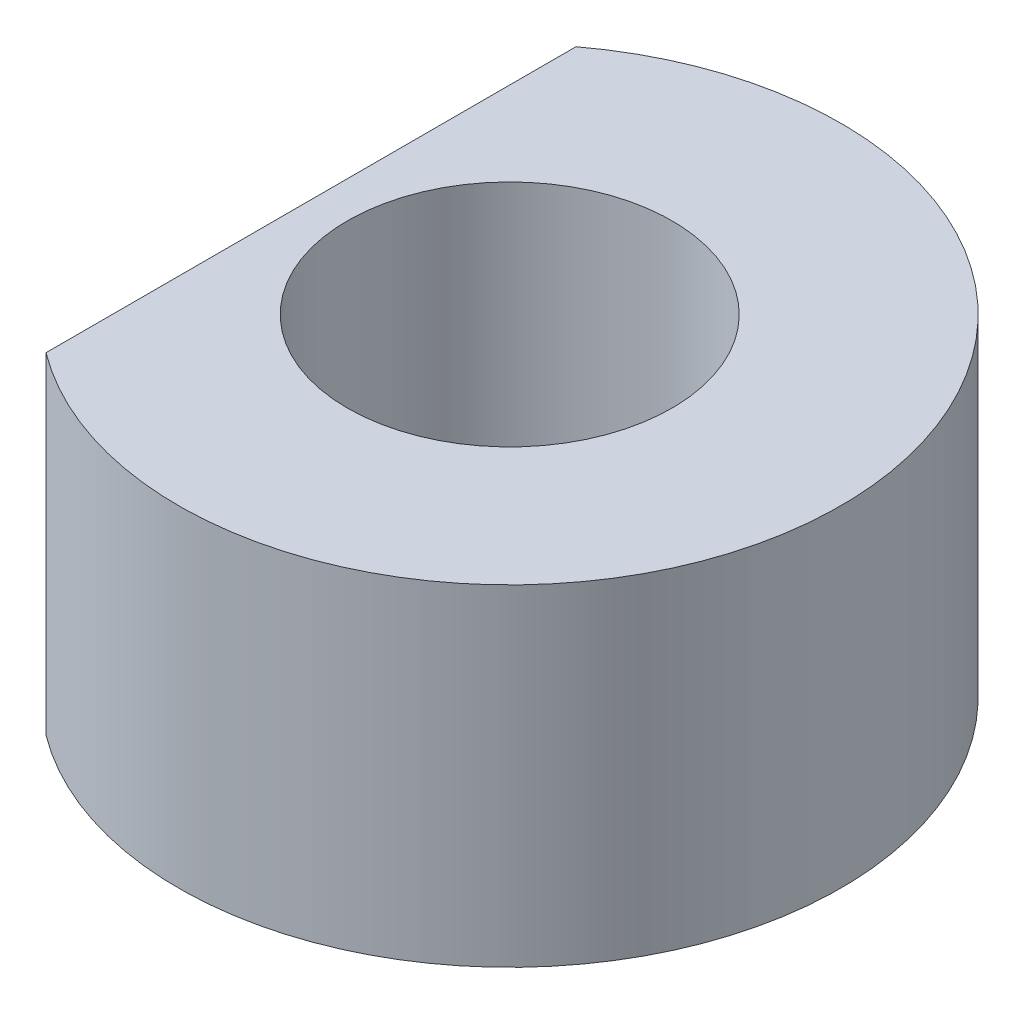
ISO-10303-21;
HEADER;
FILE_DESCRIPTION(('STEP AP214'),'2;1');
FILE_NAME('part.step','',(''),(''),'','','');
FILE_SCHEMA(('AUTOMOTIVE_DESIGN { 1 0 10303 214 1 1 1 1 }'));
ENDSEC;
DATA;
#1=APPLICATION_CONTEXT('core data for automotive mechanical design processes');
#2=APPLICATION_PROTOCOL_DEFINITION('international standard','automotive_design',2000,#1);
#3=PRODUCT_CONTEXT('',#1,'mechanical');
#4=PRODUCT('Part','Part','',(#3));
#5=PRODUCT_RELATED_PRODUCT_CATEGORY('part','',(#4));
#6=PRODUCT_DEFINITION_FORMATION('','',#4);
#7=PRODUCT_DEFINITION_CONTEXT('part definition',#1,'design');
#8=PRODUCT_DEFINITION('design','',#6,#7);
#9=PRODUCT_DEFINITION_SHAPE('','',#8);
#10=(LENGTH_UNIT() NAMED_UNIT(*) SI_UNIT(.MILLI.,.METRE.));
#11=(NAMED_UNIT(*) PLANE_ANGLE_UNIT() SI_UNIT($,.RADIAN.));
#12=(NAMED_UNIT(*) SI_UNIT($,.STERADIAN.) SOLID_ANGLE_UNIT());
#13=UNCERTAINTY_MEASURE_WITH_UNIT(LENGTH_MEASURE(1.E-05),#10,'distance_accuracy_value','');
#14=(GEOMETRIC_REPRESENTATION_CONTEXT(3) GLOBAL_UNCERTAINTY_ASSIGNED_CONTEXT((#13)) GLOBAL_UNIT_ASSIGNED_CONTEXT((#10,
#11,#12)) REPRESENTATION_CONTEXT('',''));
#15=CARTESIAN_POINT('',(0.,0.,0.));
#16=DIRECTION('',(0.,0.,1.));
#17=DIRECTION('',(1.,0.,0.));
#18=AXIS2_PLACEMENT_3D('',#15,#16,#17);
#19=CARTESIAN_POINT('',(0.,-5.,0.));
#20=DIRECTION('',(0.,1.,0.));
#21=DIRECTION('',(0.,0.,1.));
#22=AXIS2_PLACEMENT_3D('',#19,#20,#21);
#23=CYLINDRICAL_SURFACE('',#22,5.);
#24=CARTESIAN_POINT('',(0.,0.,0.));
#25=DIRECTION('',(0.,1.,0.));
#26=DIRECTION('',(0.,0.,1.));
#27=AXIS2_PLACEMENT_3D('',#24,#25,#26);
#28=CIRCLE('',#27,5.);
#29=CARTESIAN_POINT('',(-3.,0.,4.));
#30=VERTEX_POINT('',#29);
#31=CARTESIAN_POINT('',(-3.,0.,-4.));
#32=VERTEX_POINT('',#31);
#33=EDGE_CURVE('E73',#30,#32,#28,.T.);
#34=ORIENTED_EDGE('',*,*,#33,.F.);
#35=DIRECTION('',(0.,1.,0.));
#36=VECTOR('',#35,1.);
#37=CARTESIAN_POINT('',(-3.,-5.,4.));
#38=LINE('',#37,#36);
#39=CARTESIAN_POINT('',(-3.,-5.,4.));
#40=VERTEX_POINT('',#39);
#41=EDGE_CURVE('E11',#40,#30,#38,.T.);
#42=ORIENTED_EDGE('',*,*,#41,.F.);
#43=CARTESIAN_POINT('',(0.,-5.,0.));
#44=DIRECTION('',(0.,1.,0.));
#45=DIRECTION('',(0.,0.,1.));
#46=AXIS2_PLACEMENT_3D('',#43,#44,#45);
#47=CIRCLE('',#46,5.);
#48=CARTESIAN_POINT('',(-3.,-5.,-4.));
#49=VERTEX_POINT('',#48);
#50=EDGE_CURVE('E77',#40,#49,#47,.T.);
#51=ORIENTED_EDGE('',*,*,#50,.T.);
#52=DIRECTION('',(0.,1.,0.));
#53=VECTOR('',#52,1.);
#54=CARTESIAN_POINT('',(-3.,-5.,-4.));
#55=LINE('',#54,#53);
#56=EDGE_CURVE('E47',#49,#32,#55,.T.);
#57=ORIENTED_EDGE('',*,*,#56,.T.);
#58=EDGE_LOOP('',(#34,#42,#51,#57));
#59=FACE_BOUND('',#58,.T.);
#60=ADVANCED_FACE('F43',(#59),#23,.T.);
#61=CARTESIAN_POINT('',(-3.,-5.,-4.));
#62=DIRECTION('',(-1.,0.,0.));
#63=DIRECTION('',(0.,0.,1.));
#64=AXIS2_PLACEMENT_3D('',#61,#62,#63);
#65=PLANE('',#64);
#66=DIRECTION('',(0.,0.,1.));
#67=VECTOR('',#66,1.);
#68=CARTESIAN_POINT('',(-3.,0.,-4.));
#69=LINE('',#68,#67);
#70=EDGE_CURVE('E70',#32,#30,#69,.T.);
#71=ORIENTED_EDGE('',*,*,#70,.F.);
#72=ORIENTED_EDGE('',*,*,#56,.F.);
#73=DIRECTION('',(0.,0.,1.));
#74=VECTOR('',#73,1.);
#75=CARTESIAN_POINT('',(-3.,-5.,-4.));
#76=LINE('',#75,#74);
#77=EDGE_CURVE('E72',#49,#40,#76,.T.);
#78=ORIENTED_EDGE('',*,*,#77,.T.);
#79=ORIENTED_EDGE('',*,*,#41,.T.);
#80=EDGE_LOOP('',(#71,#72,#78,#79));
#81=FACE_BOUND('',#80,.T.);
#82=ADVANCED_FACE('F68',(#81),#65,.T.);
#83=CARTESIAN_POINT('',(0.,-5.,0.));
#84=DIRECTION('',(0.,1.,0.));
#85=DIRECTION('',(0.,0.,1.));
#86=AXIS2_PLACEMENT_3D('',#83,#84,#85);
#87=PLANE('',#86);
#88=CARTESIAN_POINT('',(0.,-5.,0.));
#89=DIRECTION('',(0.,1.,0.));
#90=DIRECTION('',(0.,0.,1.));
#91=AXIS2_PLACEMENT_3D('',#88,#89,#90);
#92=CIRCLE('',#91,2.45);
#93=CARTESIAN_POINT('',(0.,-5.,2.45));
#94=VERTEX_POINT('',#93);
#95=EDGE_CURVE('E75',#94,#94,#92,.T.);
#96=ORIENTED_EDGE('',*,*,#95,.T.);
#97=EDGE_LOOP('',(#96));
#98=FACE_BOUND('',#97,.T.);
#99=ORIENTED_EDGE('',*,*,#50,.F.);
#100=ORIENTED_EDGE('',*,*,#77,.F.);
#101=EDGE_LOOP('',(#99,#100));
#102=FACE_BOUND('',#101,.T.);
#103=ADVANCED_FACE('F88',(#98,#102),#87,.F.);
#104=CARTESIAN_POINT('',(0.,0.,0.));
#105=DIRECTION('',(0.,1.,0.));
#106=DIRECTION('',(0.,0.,1.));
#107=AXIS2_PLACEMENT_3D('',#104,#105,#106);
#108=PLANE('',#107);
#109=CARTESIAN_POINT('',(0.,0.,0.));
#110=DIRECTION('',(0.,1.,0.));
#111=DIRECTION('',(0.,0.,1.));
#112=AXIS2_PLACEMENT_3D('',#109,#110,#111);
#113=CIRCLE('',#112,2.45);
#114=CARTESIAN_POINT('',(0.,0.,2.45));
#115=VERTEX_POINT('',#114);
#116=EDGE_CURVE('E82',#115,#115,#113,.T.);
#117=ORIENTED_EDGE('',*,*,#116,.F.);
#118=EDGE_LOOP('',(#117));
#119=FACE_BOUND('',#118,.T.);
#120=ORIENTED_EDGE('',*,*,#33,.T.);
#121=ORIENTED_EDGE('',*,*,#70,.T.);
#122=EDGE_LOOP('',(#120,#121));
#123=FACE_BOUND('',#122,.T.);
#124=ADVANCED_FACE('F45',(#119,#123),#108,.T.);
#125=CARTESIAN_POINT('',(0.,-5.,0.));
#126=DIRECTION('',(0.,1.,0.));
#127=DIRECTION('',(0.,0.,1.));
#128=AXIS2_PLACEMENT_3D('',#125,#126,#127);
#129=CYLINDRICAL_SURFACE('',#128,2.45);
#130=ORIENTED_EDGE('',*,*,#95,.F.);
#131=EDGE_LOOP('',(#130));
#132=FACE_BOUND('',#131,.T.);
#133=ORIENTED_EDGE('',*,*,#116,.T.);
#134=EDGE_LOOP('',(#133));
#135=FACE_BOUND('',#134,.T.);
#136=ADVANCED_FACE('F91',(#132,#135),#129,.F.);
#137=CLOSED_SHELL('',(#60,#82,#103,#124,#136));
#138=MANIFOLD_SOLID_BREP('B2',#137);
#139=ADVANCED_BREP_SHAPE_REPRESENTATION('',(#18,#138),#14);
#140=SHAPE_DEFINITION_REPRESENTATION(#9,#139);
ENDSEC;
END-ISO-10303-21;
